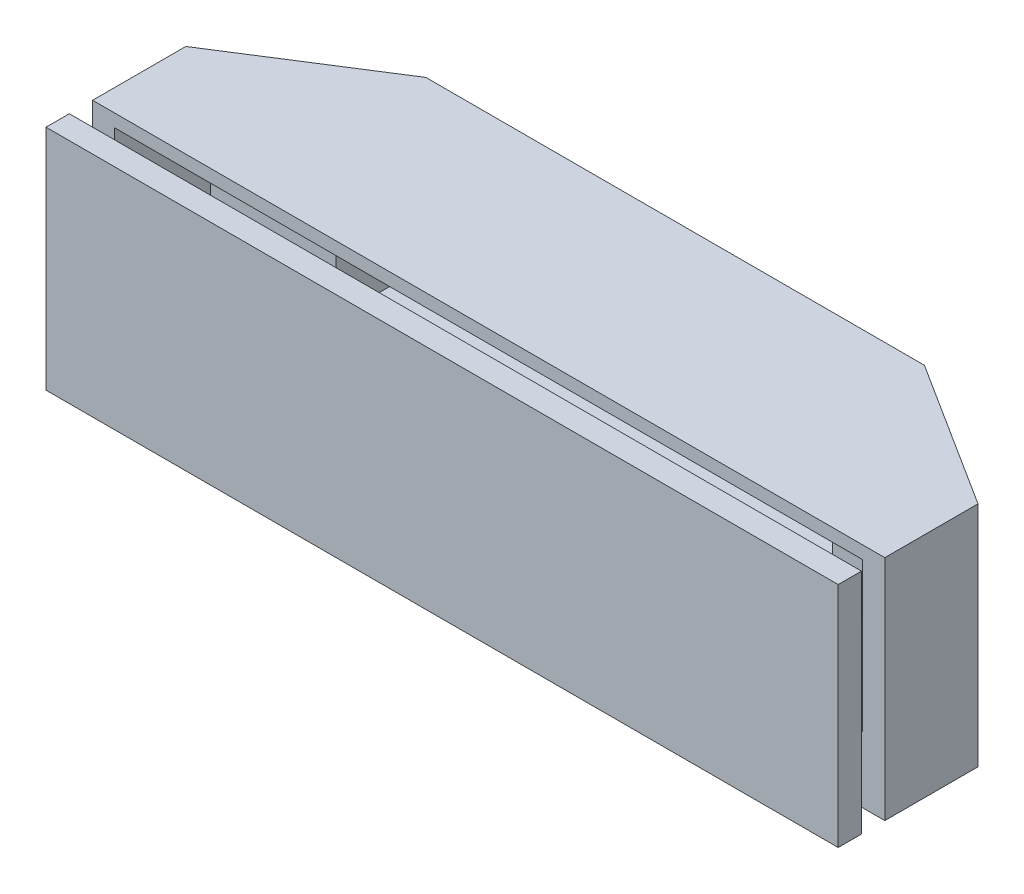
ISO-10303-21;
HEADER;
FILE_DESCRIPTION(('STEP AP214'),'2;1');
FILE_NAME('part.step','',(''),(''),'','','');
FILE_SCHEMA(('AUTOMOTIVE_DESIGN { 1 0 10303 214 1 1 1 1 }'));
ENDSEC;
DATA;
#1=APPLICATION_CONTEXT('core data for automotive mechanical design processes');
#2=APPLICATION_PROTOCOL_DEFINITION('international standard','automotive_design',2000,#1);
#3=PRODUCT_CONTEXT('',#1,'mechanical');
#4=PRODUCT('Part','Part','',(#3));
#5=PRODUCT_RELATED_PRODUCT_CATEGORY('part','',(#4));
#6=PRODUCT_DEFINITION_FORMATION('','',#4);
#7=PRODUCT_DEFINITION_CONTEXT('part definition',#1,'design');
#8=PRODUCT_DEFINITION('design','',#6,#7);
#9=PRODUCT_DEFINITION_SHAPE('','',#8);
#10=(LENGTH_UNIT() NAMED_UNIT(*) SI_UNIT(.MILLI.,.METRE.));
#11=(NAMED_UNIT(*) PLANE_ANGLE_UNIT() SI_UNIT($,.RADIAN.));
#12=(NAMED_UNIT(*) SI_UNIT($,.STERADIAN.) SOLID_ANGLE_UNIT());
#13=UNCERTAINTY_MEASURE_WITH_UNIT(LENGTH_MEASURE(1.E-05),#10,'distance_accuracy_value','');
#14=(GEOMETRIC_REPRESENTATION_CONTEXT(3) GLOBAL_UNCERTAINTY_ASSIGNED_CONTEXT((#13)) GLOBAL_UNIT_ASSIGNED_CONTEXT((#10,
#11,#12)) REPRESENTATION_CONTEXT('',''));
#15=CARTESIAN_POINT('',(0.,0.,0.));
#16=DIRECTION('',(0.,0.,1.));
#17=DIRECTION('',(1.,0.,0.));
#18=AXIS2_PLACEMENT_3D('',#15,#16,#17);
#19=CARTESIAN_POINT('',(-34.,-12.05,11.9446162465853));
#20=DIRECTION('',(0.,1.,0.));
#21=DIRECTION('',(0.,0.,1.));
#22=AXIS2_PLACEMENT_3D('',#19,#20,#21);
#23=PLANE('',#22);
#24=DIRECTION('',(1.,0.,0.));
#25=VECTOR('',#24,1.);
#26=CARTESIAN_POINT('',(-34.,-12.05,9.94461624658526));
#27=LINE('',#26,#25);
#28=CARTESIAN_POINT('',(-34.,-12.05,9.94461624658526));
#29=VERTEX_POINT('',#28);
#30=CARTESIAN_POINT('',(34.,-12.05,9.94461624658526));
#31=VERTEX_POINT('',#30);
#32=EDGE_CURVE('E112',#29,#31,#27,.T.);
#33=ORIENTED_EDGE('',*,*,#32,.T.);
#34=DIRECTION('',(0.,0.,-1.));
#35=VECTOR('',#34,1.);
#36=CARTESIAN_POINT('',(34.,-12.05,11.9446162465853));
#37=LINE('',#36,#35);
#38=CARTESIAN_POINT('',(34.,-12.05,11.9446162465853));
#39=VERTEX_POINT('',#38);
#40=EDGE_CURVE('E12',#39,#31,#37,.T.);
#41=ORIENTED_EDGE('',*,*,#40,.F.);
#42=DIRECTION('',(1.,0.,0.));
#43=VECTOR('',#42,1.);
#44=CARTESIAN_POINT('',(-34.,-12.05,11.9446162465853));
#45=LINE('',#44,#43);
#46=CARTESIAN_POINT('',(-34.,-12.05,11.9446162465853));
#47=VERTEX_POINT('',#46);
#48=EDGE_CURVE('E100',#47,#39,#45,.T.);
#49=ORIENTED_EDGE('',*,*,#48,.F.);
#50=DIRECTION('',(0.,0.,-1.));
#51=VECTOR('',#50,1.);
#52=CARTESIAN_POINT('',(-34.,-12.05,11.9446162465853));
#53=LINE('',#52,#51);
#54=EDGE_CURVE('E108',#47,#29,#53,.T.);
#55=ORIENTED_EDGE('',*,*,#54,.T.);
#56=EDGE_LOOP('',(#33,#41,#49,#55));
#57=FACE_BOUND('',#56,.T.);
#58=ADVANCED_FACE('F49',(#57),#23,.F.);
#59=CARTESIAN_POINT('',(34.,-12.05,11.9446162465853));
#60=DIRECTION('',(-1.,0.,0.));
#61=DIRECTION('',(0.,0.,1.));
#62=AXIS2_PLACEMENT_3D('',#59,#60,#61);
#63=PLANE('',#62);
#64=DIRECTION('',(0.,1.,0.));
#65=VECTOR('',#64,1.);
#66=CARTESIAN_POINT('',(34.,-12.05,9.94461624658526));
#67=LINE('',#66,#65);
#68=CARTESIAN_POINT('',(34.,7.5,9.94461624658526));
#69=VERTEX_POINT('',#68);
#70=EDGE_CURVE('E104',#31,#69,#67,.T.);
#71=ORIENTED_EDGE('',*,*,#70,.T.);
#72=DIRECTION('',(0.,0.,-1.));
#73=VECTOR('',#72,1.);
#74=CARTESIAN_POINT('',(34.,7.5,11.9446162465853));
#75=LINE('',#74,#73);
#76=CARTESIAN_POINT('',(34.,7.5,11.9446162465853));
#77=VERTEX_POINT('',#76);
#78=EDGE_CURVE('E57',#77,#69,#75,.T.);
#79=ORIENTED_EDGE('',*,*,#78,.F.);
#80=DIRECTION('',(0.,1.,0.));
#81=VECTOR('',#80,1.);
#82=CARTESIAN_POINT('',(34.,-12.05,11.9446162465853));
#83=LINE('',#82,#81);
#84=EDGE_CURVE('E95',#39,#77,#83,.T.);
#85=ORIENTED_EDGE('',*,*,#84,.F.);
#86=ORIENTED_EDGE('',*,*,#40,.T.);
#87=EDGE_LOOP('',(#71,#79,#85,#86));
#88=FACE_BOUND('',#87,.T.);
#89=ADVANCED_FACE('F103',(#88),#63,.F.);
#90=CARTESIAN_POINT('',(34.,7.5,11.9446162465853));
#91=DIRECTION('',(0.,-1.,0.));
#92=DIRECTION('',(0.,0.,-1.));
#93=AXIS2_PLACEMENT_3D('',#90,#91,#92);
#94=PLANE('',#93);
#95=DIRECTION('',(-1.,0.,0.));
#96=VECTOR('',#95,1.);
#97=CARTESIAN_POINT('',(34.,7.5,9.94461624658526));
#98=LINE('',#97,#96);
#99=CARTESIAN_POINT('',(-34.,7.5,9.94461624658526));
#100=VERTEX_POINT('',#99);
#101=EDGE_CURVE('E82',#69,#100,#98,.T.);
#102=ORIENTED_EDGE('',*,*,#101,.T.);
#103=DIRECTION('',(0.,0.,-1.));
#104=VECTOR('',#103,1.);
#105=CARTESIAN_POINT('',(-34.,7.5,11.9446162465853));
#106=LINE('',#105,#104);
#107=CARTESIAN_POINT('',(-34.,7.5,11.9446162465853));
#108=VERTEX_POINT('',#107);
#109=EDGE_CURVE('E105',#108,#100,#106,.T.);
#110=ORIENTED_EDGE('',*,*,#109,.F.);
#111=DIRECTION('',(-1.,0.,0.));
#112=VECTOR('',#111,1.);
#113=CARTESIAN_POINT('',(34.,7.5,11.9446162465853));
#114=LINE('',#113,#112);
#115=EDGE_CURVE('E98',#77,#108,#114,.T.);
#116=ORIENTED_EDGE('',*,*,#115,.F.);
#117=ORIENTED_EDGE('',*,*,#78,.T.);
#118=EDGE_LOOP('',(#102,#110,#116,#117));
#119=FACE_BOUND('',#118,.T.);
#120=ADVANCED_FACE('F106',(#119),#94,.F.);
#121=CARTESIAN_POINT('',(-34.,7.5,11.9446162465853));
#122=DIRECTION('',(1.,0.,0.));
#123=DIRECTION('',(0.,0.,-1.));
#124=AXIS2_PLACEMENT_3D('',#121,#122,#123);
#125=PLANE('',#124);
#126=DIRECTION('',(0.,-1.,0.));
#127=VECTOR('',#126,1.);
#128=CARTESIAN_POINT('',(-34.,7.5,9.94461624658526));
#129=LINE('',#128,#127);
#130=EDGE_CURVE('E88',#100,#29,#129,.T.);
#131=ORIENTED_EDGE('',*,*,#130,.T.);
#132=ORIENTED_EDGE('',*,*,#54,.F.);
#133=DIRECTION('',(0.,-1.,0.));
#134=VECTOR('',#133,1.);
#135=CARTESIAN_POINT('',(-34.,7.5,11.9446162465853));
#136=LINE('',#135,#134);
#137=EDGE_CURVE('E65',#108,#47,#136,.T.);
#138=ORIENTED_EDGE('',*,*,#137,.F.);
#139=ORIENTED_EDGE('',*,*,#109,.T.);
#140=EDGE_LOOP('',(#131,#132,#138,#139));
#141=FACE_BOUND('',#140,.T.);
#142=ADVANCED_FACE('F119',(#141),#125,.F.);
#143=CARTESIAN_POINT('',(0.,0.,11.9446162465853));
#144=DIRECTION('',(0.,0.,1.));
#145=DIRECTION('',(1.,0.,0.));
#146=AXIS2_PLACEMENT_3D('',#143,#144,#145);
#147=PLANE('',#146);
#148=ORIENTED_EDGE('',*,*,#48,.T.);
#149=ORIENTED_EDGE('',*,*,#84,.T.);
#150=ORIENTED_EDGE('',*,*,#115,.T.);
#151=ORIENTED_EDGE('',*,*,#137,.T.);
#152=EDGE_LOOP('',(#148,#149,#150,#151));
#153=FACE_BOUND('',#152,.T.);
#154=ADVANCED_FACE('F96',(#153),#147,.T.);
#155=CARTESIAN_POINT('',(0.,0.,9.94461624658526));
#156=DIRECTION('',(0.,0.,1.));
#157=DIRECTION('',(1.,0.,0.));
#158=AXIS2_PLACEMENT_3D('',#155,#156,#157);
#159=PLANE('',#158);
#160=ORIENTED_EDGE('',*,*,#32,.F.);
#161=ORIENTED_EDGE('',*,*,#130,.F.);
#162=ORIENTED_EDGE('',*,*,#101,.F.);
#163=ORIENTED_EDGE('',*,*,#70,.F.);
#164=EDGE_LOOP('',(#160,#161,#162,#163));
#165=FACE_BOUND('',#164,.T.);
#166=ADVANCED_FACE('F122',(#165),#159,.F.);
#167=CLOSED_SHELL('',(#58,#89,#120,#142,#154,#166));
#168=MANIFOLD_SOLID_BREP('B2_NOT_SHOWN',#167);
#169=CARTESIAN_POINT('',(21.3,6.4,-7.2));
#170=DIRECTION('',(1.,0.,0.));
#171=DIRECTION('',(0.,1.,0.));
#172=AXIS2_PLACEMENT_3D('',#169,#170,#171);
#173=PLANE('',#172);
#174=DIRECTION('',(0.,-1.,0.));
#175=VECTOR('',#174,1.);
#176=CARTESIAN_POINT('',(21.3,6.4,-0.25538375341474));
#177=LINE('',#176,#175);
#178=CARTESIAN_POINT('',(21.3,6.4,-0.25538375341474));
#179=VERTEX_POINT('',#178);
#180=CARTESIAN_POINT('',(21.3,-6.4,-0.25538375341474));
#181=VERTEX_POINT('',#180);
#182=EDGE_CURVE('E314',#179,#181,#177,.T.);
#183=ORIENTED_EDGE('',*,*,#182,.F.);
#184=DIRECTION('',(0.,0.,1.));
#185=VECTOR('',#184,1.);
#186=CARTESIAN_POINT('',(21.3,6.4,-7.2));
#187=LINE('',#186,#185);
#188=CARTESIAN_POINT('',(21.3,6.4,-7.2));
#189=VERTEX_POINT('',#188);
#190=EDGE_CURVE('E289',#189,#179,#187,.T.);
#191=ORIENTED_EDGE('',*,*,#190,.F.);
#192=DIRECTION('',(0.,1.,0.));
#193=VECTOR('',#192,1.);
#194=CARTESIAN_POINT('',(21.3,6.4,-7.2));
#195=LINE('',#194,#193);
#196=CARTESIAN_POINT('',(21.3,-6.4,-7.2));
#197=VERTEX_POINT('',#196);
#198=EDGE_CURVE('E320',#197,#189,#195,.T.);
#199=ORIENTED_EDGE('',*,*,#198,.F.);
#200=DIRECTION('',(0.,0.,1.));
#201=VECTOR('',#200,1.);
#202=CARTESIAN_POINT('',(21.3,-6.4,-7.2));
#203=LINE('',#202,#201);
#204=EDGE_CURVE('E332',#197,#181,#203,.T.);
#205=ORIENTED_EDGE('',*,*,#204,.T.);
#206=EDGE_LOOP('',(#183,#191,#199,#205));
#207=FACE_BOUND('',#206,.T.);
#208=ADVANCED_FACE('F172',(#207),#173,.F.);
#209=CARTESIAN_POINT('',(-21.3,6.4,-7.2));
#210=DIRECTION('',(-1.,0.,0.));
#211=DIRECTION('',(0.,0.,1.));
#212=AXIS2_PLACEMENT_3D('',#209,#210,#211);
#213=PLANE('',#212);
#214=DIRECTION('',(0.,1.,0.));
#215=VECTOR('',#214,1.);
#216=CARTESIAN_POINT('',(-21.3,6.4,-0.25538375341474));
#217=LINE('',#216,#215);
#218=CARTESIAN_POINT('',(-21.3,-6.4,-0.25538375341474));
#219=VERTEX_POINT('',#218);
#220=CARTESIAN_POINT('',(-21.3,6.4,-0.25538375341474));
#221=VERTEX_POINT('',#220);
#222=EDGE_CURVE('E307',#219,#221,#217,.T.);
#223=ORIENTED_EDGE('',*,*,#222,.F.);
#224=DIRECTION('',(0.,0.,1.));
#225=VECTOR('',#224,1.);
#226=CARTESIAN_POINT('',(-21.3,-6.4,-7.2));
#227=LINE('',#226,#225);
#228=CARTESIAN_POINT('',(-21.3,-6.4,-7.2));
#229=VERTEX_POINT('',#228);
#230=EDGE_CURVE('E336',#229,#219,#227,.T.);
#231=ORIENTED_EDGE('',*,*,#230,.F.);
#232=DIRECTION('',(0.,-1.,0.));
#233=VECTOR('',#232,1.);
#234=CARTESIAN_POINT('',(-21.3,6.4,-7.2));
#235=LINE('',#234,#233);
#236=CARTESIAN_POINT('',(-21.3,6.4,-7.2));
#237=VERTEX_POINT('',#236);
#238=EDGE_CURVE('E326',#237,#229,#235,.T.);
#239=ORIENTED_EDGE('',*,*,#238,.F.);
#240=DIRECTION('',(0.,0.,1.));
#241=VECTOR('',#240,1.);
#242=CARTESIAN_POINT('',(-21.3,6.4,-7.2));
#243=LINE('',#242,#241);
#244=EDGE_CURVE('E339',#237,#221,#243,.T.);
#245=ORIENTED_EDGE('',*,*,#244,.T.);
#246=EDGE_LOOP('',(#223,#231,#239,#245));
#247=FACE_BOUND('',#246,.T.);
#248=ADVANCED_FACE('F419',(#247),#213,.F.);
#249=CARTESIAN_POINT('',(34.,-12.05,7.94461624658526));
#250=DIRECTION('',(0.,0.,1.));
#251=DIRECTION('',(1.,0.,0.));
#252=AXIS2_PLACEMENT_3D('',#249,#250,#251);
#253=PLANE('',#252);
#254=DIRECTION('',(0.,1.,0.));
#255=VECTOR('',#254,1.);
#256=CARTESIAN_POINT('',(32.1,6.4,7.94461624658526));
#257=LINE('',#256,#255);
#258=CARTESIAN_POINT('',(32.1,-6.4,7.94461624658526));
#259=VERTEX_POINT('',#258);
#260=CARTESIAN_POINT('',(32.1,6.4,7.94461624658526));
#261=VERTEX_POINT('',#260);
#262=EDGE_CURVE('E282',#259,#261,#257,.T.);
#263=ORIENTED_EDGE('',*,*,#262,.F.);
#264=DIRECTION('',(1.,0.,0.));
#265=VECTOR('',#264,1.);
#266=CARTESIAN_POINT('',(-21.3,-6.4,7.94461624658526));
#267=LINE('',#266,#265);
#268=CARTESIAN_POINT('',(-32.1,-6.4,7.94461624658526));
#269=VERTEX_POINT('',#268);
#270=EDGE_CURVE('E318',#269,#259,#267,.T.);
#271=ORIENTED_EDGE('',*,*,#270,.F.);
#272=DIRECTION('',(0.,-1.,0.));
#273=VECTOR('',#272,1.);
#274=CARTESIAN_POINT('',(-32.1,6.4,7.94461624658526));
#275=LINE('',#274,#273);
#276=CARTESIAN_POINT('',(-32.1,6.4,7.94461624658526));
#277=VERTEX_POINT('',#276);
#278=EDGE_CURVE('E297',#277,#269,#275,.T.);
#279=ORIENTED_EDGE('',*,*,#278,.F.);
#280=DIRECTION('',(-1.,0.,0.));
#281=VECTOR('',#280,1.);
#282=CARTESIAN_POINT('',(-21.3,6.4,7.94461624658526));
#283=LINE('',#282,#281);
#284=EDGE_CURVE('E316',#261,#277,#283,.T.);
#285=ORIENTED_EDGE('',*,*,#284,.F.);
#286=EDGE_LOOP('',(#263,#271,#279,#285));
#287=FACE_BOUND('',#286,.T.);
#288=DIRECTION('',(0.,1.,0.));
#289=VECTOR('',#288,1.);
#290=CARTESIAN_POINT('',(34.,-12.05,7.94461624658526));
#291=LINE('',#290,#289);
#292=CARTESIAN_POINT('',(34.,-12.05,7.94461624658526));
#293=VERTEX_POINT('',#292);
#294=CARTESIAN_POINT('',(34.,7.5,7.94461624658526));
#295=VERTEX_POINT('',#294);
#296=EDGE_CURVE('E382',#293,#295,#291,.T.);
#297=ORIENTED_EDGE('',*,*,#296,.T.);
#298=DIRECTION('',(1.,0.,0.));
#299=VECTOR('',#298,1.);
#300=CARTESIAN_POINT('',(34.,7.5,7.94461624658526));
#301=LINE('',#300,#299);
#302=CARTESIAN_POINT('',(-34.,7.5,7.94461624658526));
#303=VERTEX_POINT('',#302);
#304=EDGE_CURVE('E345',#303,#295,#301,.T.);
#305=ORIENTED_EDGE('',*,*,#304,.F.);
#306=DIRECTION('',(0.,1.,0.));
#307=VECTOR('',#306,1.);
#308=CARTESIAN_POINT('',(-34.,-12.05,7.94461624658526));
#309=LINE('',#308,#307);
#310=CARTESIAN_POINT('',(-34.,-12.05,7.94461624658526));
#311=VERTEX_POINT('',#310);
#312=EDGE_CURVE('E176',#311,#303,#309,.T.);
#313=ORIENTED_EDGE('',*,*,#312,.F.);
#314=DIRECTION('',(1.,0.,0.));
#315=VECTOR('',#314,1.);
#316=CARTESIAN_POINT('',(34.,-12.05,7.94461624658526));
#317=LINE('',#316,#315);
#318=EDGE_CURVE('E363',#311,#293,#317,.T.);
#319=ORIENTED_EDGE('',*,*,#318,.T.);
#320=EDGE_LOOP('',(#297,#305,#313,#319));
#321=FACE_BOUND('',#320,.T.);
#322=ADVANCED_FACE('F389',(#287,#321),#253,.T.);
#323=CARTESIAN_POINT('',(-34.,-12.05,7.94461624658526));
#324=DIRECTION('',(-1.,0.,0.));
#325=DIRECTION('',(0.,0.,1.));
#326=AXIS2_PLACEMENT_3D('',#323,#324,#325);
#327=PLANE('',#326);
#328=ORIENTED_EDGE('',*,*,#312,.T.);
#329=DIRECTION('',(0.,0.,1.));
#330=VECTOR('',#329,1.);
#331=CARTESIAN_POINT('',(-34.,7.5,7.94461624658526));
#332=LINE('',#331,#330);
#333=CARTESIAN_POINT('',(-34.,7.5,-0.0553837534147412));
#334=VERTEX_POINT('',#333);
#335=EDGE_CURVE('E335',#334,#303,#332,.T.);
#336=ORIENTED_EDGE('',*,*,#335,.F.);
#337=DIRECTION('',(0.,1.,0.));
#338=VECTOR('',#337,1.);
#339=CARTESIAN_POINT('',(-34.,-12.05,-0.0553837534147412));
#340=LINE('',#339,#338);
#341=CARTESIAN_POINT('',(-34.,-12.05,-0.0553837534147412));
#342=VERTEX_POINT('',#341);
#343=EDGE_CURVE('E47',#342,#334,#340,.T.);
#344=ORIENTED_EDGE('',*,*,#343,.F.);
#345=DIRECTION('',(0.,0.,1.));
#346=VECTOR('',#345,1.);
#347=CARTESIAN_POINT('',(-34.,-12.05,7.94461624658526));
#348=LINE('',#347,#346);
#349=EDGE_CURVE('E360',#342,#311,#348,.T.);
#350=ORIENTED_EDGE('',*,*,#349,.T.);
#351=EDGE_LOOP('',(#328,#336,#344,#350));
#352=FACE_BOUND('',#351,.T.);
#353=ADVANCED_FACE('F174',(#352),#327,.T.);
#354=CARTESIAN_POINT('',(-34.,-12.05,-0.0553837534147412));
#355=DIRECTION('',(-0.536008136665272,0.,-0.844212815247804));
#356=DIRECTION('',(-0.844212815247804,0.,0.536008136665272));
#357=AXIS2_PLACEMENT_3D('',#354,#355,#356);
#358=PLANE('',#357);
#359=ORIENTED_EDGE('',*,*,#343,.T.);
#360=DIRECTION('',(-0.844212815247804,0.,0.536008136665272));
#361=VECTOR('',#360,1.);
#362=CARTESIAN_POINT('',(-34.,7.5,-0.0553837534147412));
#363=LINE('',#362,#361);
#364=CARTESIAN_POINT('',(-21.4,7.5,-8.05538375341474));
#365=VERTEX_POINT('',#364);
#366=EDGE_CURVE('E357',#365,#334,#363,.T.);
#367=ORIENTED_EDGE('',*,*,#366,.F.);
#368=DIRECTION('',(0.,1.,0.));
#369=VECTOR('',#368,1.);
#370=CARTESIAN_POINT('',(-21.4,-12.05,-8.05538375341474));
#371=LINE('',#370,#369);
#372=CARTESIAN_POINT('',(-21.4,-12.05,-8.05538375341474));
#373=VERTEX_POINT('',#372);
#374=EDGE_CURVE('E181',#373,#365,#371,.T.);
#375=ORIENTED_EDGE('',*,*,#374,.F.);
#376=DIRECTION('',(-0.844212815247804,0.,0.536008136665272));
#377=VECTOR('',#376,1.);
#378=CARTESIAN_POINT('',(-34.,-12.05,-0.0553837534147412));
#379=LINE('',#378,#377);
#380=EDGE_CURVE('E375',#373,#342,#379,.T.);
#381=ORIENTED_EDGE('',*,*,#380,.T.);
#382=EDGE_LOOP('',(#359,#367,#375,#381));
#383=FACE_BOUND('',#382,.T.);
#384=ADVANCED_FACE('F396',(#383),#358,.T.);
#385=CARTESIAN_POINT('',(-21.4,-12.05,-8.05538375341474));
#386=DIRECTION('',(0.,0.,-1.));
#387=DIRECTION('',(-1.,0.,0.));
#388=AXIS2_PLACEMENT_3D('',#385,#386,#387);
#389=PLANE('',#388);
#390=ORIENTED_EDGE('',*,*,#374,.T.);
#391=DIRECTION('',(-1.,0.,0.));
#392=VECTOR('',#391,1.);
#393=CARTESIAN_POINT('',(-21.4,7.5,-8.05538375341474));
#394=LINE('',#393,#392);
#395=CARTESIAN_POINT('',(21.4,7.5,-8.05538375341474));
#396=VERTEX_POINT('',#395);
#397=EDGE_CURVE('E354',#396,#365,#394,.T.);
#398=ORIENTED_EDGE('',*,*,#397,.F.);
#399=DIRECTION('',(0.,1.,0.));
#400=VECTOR('',#399,1.);
#401=CARTESIAN_POINT('',(21.4,-12.05,-8.05538375341474));
#402=LINE('',#401,#400);
#403=CARTESIAN_POINT('',(21.4,-12.05,-8.05538375341474));
#404=VERTEX_POINT('',#403);
#405=EDGE_CURVE('E379',#404,#396,#402,.T.);
#406=ORIENTED_EDGE('',*,*,#405,.F.);
#407=DIRECTION('',(-1.,0.,0.));
#408=VECTOR('',#407,1.);
#409=CARTESIAN_POINT('',(-21.4,-12.05,-8.05538375341474));
#410=LINE('',#409,#408);
#411=EDGE_CURVE('E372',#404,#373,#410,.T.);
#412=ORIENTED_EDGE('',*,*,#411,.T.);
#413=EDGE_LOOP('',(#390,#398,#406,#412));
#414=FACE_BOUND('',#413,.T.);
#415=ADVANCED_FACE('F409',(#414),#389,.T.);
#416=CARTESIAN_POINT('',(21.4,-12.05,-8.05538375341474));
#417=DIRECTION('',(0.536008136665272,0.,-0.844212815247804));
#418=DIRECTION('',(-0.844212815247804,0.,-0.536008136665272));
#419=AXIS2_PLACEMENT_3D('',#416,#417,#418);
#420=PLANE('',#419);
#421=ORIENTED_EDGE('',*,*,#405,.T.);
#422=DIRECTION('',(-0.844212815247804,0.,-0.536008136665272));
#423=VECTOR('',#422,1.);
#424=CARTESIAN_POINT('',(21.4,7.5,-8.05538375341474));
#425=LINE('',#424,#423);
#426=CARTESIAN_POINT('',(34.,7.5,-0.0553837534147412));
#427=VERTEX_POINT('',#426);
#428=EDGE_CURVE('E351',#427,#396,#425,.T.);
#429=ORIENTED_EDGE('',*,*,#428,.F.);
#430=DIRECTION('',(0.,1.,0.));
#431=VECTOR('',#430,1.);
#432=CARTESIAN_POINT('',(34.,-12.05,-0.0553837534147412));
#433=LINE('',#432,#431);
#434=CARTESIAN_POINT('',(34.,-12.05,-0.0553837534147412));
#435=VERTEX_POINT('',#434);
#436=EDGE_CURVE('E381',#435,#427,#433,.T.);
#437=ORIENTED_EDGE('',*,*,#436,.F.);
#438=DIRECTION('',(-0.844212815247804,0.,-0.536008136665272));
#439=VECTOR('',#438,1.);
#440=CARTESIAN_POINT('',(21.4,-12.05,-8.05538375341474));
#441=LINE('',#440,#439);
#442=EDGE_CURVE('E369',#435,#404,#441,.T.);
#443=ORIENTED_EDGE('',*,*,#442,.T.);
#444=EDGE_LOOP('',(#421,#429,#437,#443));
#445=FACE_BOUND('',#444,.T.);
#446=ADVANCED_FACE('F407',(#445),#420,.T.);
#447=CARTESIAN_POINT('',(34.,-12.05,-0.0553837534147412));
#448=DIRECTION('',(1.,0.,0.));
#449=DIRECTION('',(0.,0.,-1.));
#450=AXIS2_PLACEMENT_3D('',#447,#448,#449);
#451=PLANE('',#450);
#452=ORIENTED_EDGE('',*,*,#436,.T.);
#453=DIRECTION('',(0.,0.,-1.));
#454=VECTOR('',#453,1.);
#455=CARTESIAN_POINT('',(34.,7.5,-0.0553837534147412));
#456=LINE('',#455,#454);
#457=EDGE_CURVE('E348',#295,#427,#456,.T.);
#458=ORIENTED_EDGE('',*,*,#457,.F.);
#459=ORIENTED_EDGE('',*,*,#296,.F.);
#460=DIRECTION('',(0.,0.,-1.));
#461=VECTOR('',#460,1.);
#462=CARTESIAN_POINT('',(34.,-12.05,-0.0553837534147412));
#463=LINE('',#462,#461);
#464=EDGE_CURVE('E366',#293,#435,#463,.T.);
#465=ORIENTED_EDGE('',*,*,#464,.T.);
#466=EDGE_LOOP('',(#452,#458,#459,#465));
#467=FACE_BOUND('',#466,.T.);
#468=ADVANCED_FACE('F404',(#467),#451,.T.);
#469=CARTESIAN_POINT('',(0.,-12.05,0.));
#470=DIRECTION('',(0.,-1.,0.));
#471=DIRECTION('',(0.,0.,-1.));
#472=AXIS2_PLACEMENT_3D('',#469,#470,#471);
#473=PLANE('',#472);
#474=ORIENTED_EDGE('',*,*,#349,.F.);
#475=ORIENTED_EDGE('',*,*,#380,.F.);
#476=ORIENTED_EDGE('',*,*,#411,.F.);
#477=ORIENTED_EDGE('',*,*,#442,.F.);
#478=ORIENTED_EDGE('',*,*,#464,.F.);
#479=ORIENTED_EDGE('',*,*,#318,.F.);
#480=EDGE_LOOP('',(#474,#475,#476,#477,#478,#479));
#481=FACE_BOUND('',#480,.T.);
#482=ADVANCED_FACE('F399',(#481),#473,.T.);
#483=CARTESIAN_POINT('',(0.,7.5,0.));
#484=DIRECTION('',(0.,-1.,0.));
#485=DIRECTION('',(0.,0.,-1.));
#486=AXIS2_PLACEMENT_3D('',#483,#484,#485);
#487=PLANE('',#486);
#488=ORIENTED_EDGE('',*,*,#335,.T.);
#489=ORIENTED_EDGE('',*,*,#304,.T.);
#490=ORIENTED_EDGE('',*,*,#457,.T.);
#491=ORIENTED_EDGE('',*,*,#428,.T.);
#492=ORIENTED_EDGE('',*,*,#397,.T.);
#493=ORIENTED_EDGE('',*,*,#366,.T.);
#494=EDGE_LOOP('',(#488,#489,#490,#491,#492,#493));
#495=FACE_BOUND('',#494,.T.);
#496=ADVANCED_FACE('F392',(#495),#487,.F.);
#497=CARTESIAN_POINT('',(-21.3,-6.4,-7.2));
#498=DIRECTION('',(0.,-1.,0.));
#499=DIRECTION('',(0.,0.,-1.));
#500=AXIS2_PLACEMENT_3D('',#497,#498,#499);
#501=PLANE('',#500);
#502=ORIENTED_EDGE('',*,*,#270,.T.);
#503=DIRECTION('',(0.,0.,1.));
#504=VECTOR('',#503,1.);
#505=CARTESIAN_POINT('',(32.1,-6.4,-0.25538375341474));
#506=LINE('',#505,#504);
#507=CARTESIAN_POINT('',(32.1,-6.4,-0.25538375341474));
#508=VERTEX_POINT('',#507);
#509=EDGE_CURVE('E305',#508,#259,#506,.T.);
#510=ORIENTED_EDGE('',*,*,#509,.F.);
#511=DIRECTION('',(1.,0.,0.));
#512=VECTOR('',#511,1.);
#513=CARTESIAN_POINT('',(-32.1,-6.4,-0.25538375341474));
#514=LINE('',#513,#512);
#515=EDGE_CURVE('E295',#181,#508,#514,.T.);
#516=ORIENTED_EDGE('',*,*,#515,.F.);
#517=ORIENTED_EDGE('',*,*,#204,.F.);
#518=DIRECTION('',(1.,0.,0.));
#519=VECTOR('',#518,1.);
#520=CARTESIAN_POINT('',(-21.3,-6.4,-7.2));
#521=LINE('',#520,#519);
#522=EDGE_CURVE('E329',#229,#197,#521,.T.);
#523=ORIENTED_EDGE('',*,*,#522,.F.);
#524=ORIENTED_EDGE('',*,*,#230,.T.);
#525=CARTESIAN_POINT('',(-32.1,-6.4,-0.25538375341474));
#526=VERTEX_POINT('',#525);
#527=EDGE_CURVE('E189',#526,#219,#514,.T.);
#528=ORIENTED_EDGE('',*,*,#527,.F.);
#529=DIRECTION('',(0.,0.,1.));
#530=VECTOR('',#529,1.);
#531=CARTESIAN_POINT('',(-32.1,-6.4,-0.25538375341474));
#532=LINE('',#531,#530);
#533=EDGE_CURVE('E308',#526,#269,#532,.T.);
#534=ORIENTED_EDGE('',*,*,#533,.T.);
#535=EDGE_LOOP('',(#502,#510,#516,#517,#523,#524,#528,#534));
#536=FACE_BOUND('',#535,.T.);
#537=ADVANCED_FACE('F431',(#536),#501,.F.);
#538=CARTESIAN_POINT('',(-21.3,6.4,-7.2));
#539=DIRECTION('',(0.,1.,0.));
#540=DIRECTION('',(0.,0.,1.));
#541=AXIS2_PLACEMENT_3D('',#538,#539,#540);
#542=PLANE('',#541);
#543=ORIENTED_EDGE('',*,*,#284,.T.);
#544=DIRECTION('',(0.,0.,1.));
#545=VECTOR('',#544,1.);
#546=CARTESIAN_POINT('',(-32.1,6.4,-0.25538375341474));
#547=LINE('',#546,#545);
#548=CARTESIAN_POINT('',(-32.1,6.4,-0.25538375341474));
#549=VERTEX_POINT('',#548);
#550=EDGE_CURVE('E284',#549,#277,#547,.T.);
#551=ORIENTED_EDGE('',*,*,#550,.F.);
#552=DIRECTION('',(-1.,0.,0.));
#553=VECTOR('',#552,1.);
#554=CARTESIAN_POINT('',(-32.1,6.4,-0.25538375341474));
#555=LINE('',#554,#553);
#556=EDGE_CURVE('E291',#221,#549,#555,.T.);
#557=ORIENTED_EDGE('',*,*,#556,.F.);
#558=ORIENTED_EDGE('',*,*,#244,.F.);
#559=DIRECTION('',(-1.,0.,0.));
#560=VECTOR('',#559,1.);
#561=CARTESIAN_POINT('',(-21.3,6.4,-7.2));
#562=LINE('',#561,#560);
#563=EDGE_CURVE('E323',#189,#237,#562,.T.);
#564=ORIENTED_EDGE('',*,*,#563,.F.);
#565=ORIENTED_EDGE('',*,*,#190,.T.);
#566=CARTESIAN_POINT('',(32.1,6.4,-0.25538375341474));
#567=VERTEX_POINT('',#566);
#568=EDGE_CURVE('E197',#567,#179,#555,.T.);
#569=ORIENTED_EDGE('',*,*,#568,.F.);
#570=DIRECTION('',(0.,0.,1.));
#571=VECTOR('',#570,1.);
#572=CARTESIAN_POINT('',(32.1,6.4,-0.25538375341474));
#573=LINE('',#572,#571);
#574=EDGE_CURVE('E277',#567,#261,#573,.T.);
#575=ORIENTED_EDGE('',*,*,#574,.T.);
#576=EDGE_LOOP('',(#543,#551,#557,#558,#564,#565,#569,#575));
#577=FACE_BOUND('',#576,.T.);
#578=ADVANCED_FACE('F287',(#577),#542,.F.);
#579=CARTESIAN_POINT('',(0.,0.,-7.2));
#580=DIRECTION('',(0.,0.,1.));
#581=DIRECTION('',(1.,0.,0.));
#582=AXIS2_PLACEMENT_3D('',#579,#580,#581);
#583=PLANE('',#582);
#584=ORIENTED_EDGE('',*,*,#198,.T.);
#585=ORIENTED_EDGE('',*,*,#563,.T.);
#586=ORIENTED_EDGE('',*,*,#238,.T.);
#587=ORIENTED_EDGE('',*,*,#522,.T.);
#588=EDGE_LOOP('',(#584,#585,#586,#587));
#589=FACE_BOUND('',#588,.T.);
#590=ADVANCED_FACE('F455',(#589),#583,.T.);
#591=CARTESIAN_POINT('',(0.,0.,-0.25538375341474));
#592=DIRECTION('',(0.,0.,1.));
#593=DIRECTION('',(1.,0.,0.));
#594=AXIS2_PLACEMENT_3D('',#591,#592,#593);
#595=PLANE('',#594);
#596=ORIENTED_EDGE('',*,*,#222,.T.);
#597=ORIENTED_EDGE('',*,*,#556,.T.);
#598=DIRECTION('',(0.,-1.,0.));
#599=VECTOR('',#598,1.);
#600=CARTESIAN_POINT('',(-32.1,6.4,-0.25538375341474));
#601=LINE('',#600,#599);
#602=EDGE_CURVE('E290',#549,#526,#601,.T.);
#603=ORIENTED_EDGE('',*,*,#602,.T.);
#604=ORIENTED_EDGE('',*,*,#527,.T.);
#605=EDGE_LOOP('',(#596,#597,#603,#604));
#606=FACE_BOUND('',#605,.T.);
#607=ADVANCED_FACE('F450',(#606),#595,.T.);
#608=CARTESIAN_POINT('',(-32.1,6.4,-0.25538375341474));
#609=DIRECTION('',(-1.,0.,0.));
#610=DIRECTION('',(0.,0.,1.));
#611=AXIS2_PLACEMENT_3D('',#608,#609,#610);
#612=PLANE('',#611);
#613=ORIENTED_EDGE('',*,*,#278,.T.);
#614=ORIENTED_EDGE('',*,*,#533,.F.);
#615=ORIENTED_EDGE('',*,*,#602,.F.);
#616=ORIENTED_EDGE('',*,*,#550,.T.);
#617=EDGE_LOOP('',(#613,#614,#615,#616));
#618=FACE_BOUND('',#617,.T.);
#619=ADVANCED_FACE('F449',(#618),#612,.F.);
#620=ORIENTED_EDGE('',*,*,#182,.T.);
#621=ORIENTED_EDGE('',*,*,#515,.T.);
#622=DIRECTION('',(0.,1.,0.));
#623=VECTOR('',#622,1.);
#624=CARTESIAN_POINT('',(32.1,6.4,-0.25538375341474));
#625=LINE('',#624,#623);
#626=EDGE_CURVE('E280',#508,#567,#625,.T.);
#627=ORIENTED_EDGE('',*,*,#626,.T.);
#628=ORIENTED_EDGE('',*,*,#568,.T.);
#629=EDGE_LOOP('',(#620,#621,#627,#628));
#630=FACE_BOUND('',#629,.T.);
#631=ADVANCED_FACE('F293',(#630),#595,.T.);
#632=CARTESIAN_POINT('',(32.1,6.4,-0.25538375341474));
#633=DIRECTION('',(1.,0.,0.));
#634=DIRECTION('',(0.,0.,-1.));
#635=AXIS2_PLACEMENT_3D('',#632,#633,#634);
#636=PLANE('',#635);
#637=ORIENTED_EDGE('',*,*,#262,.T.);
#638=ORIENTED_EDGE('',*,*,#574,.F.);
#639=ORIENTED_EDGE('',*,*,#626,.F.);
#640=ORIENTED_EDGE('',*,*,#509,.T.);
#641=EDGE_LOOP('',(#637,#638,#639,#640));
#642=FACE_BOUND('',#641,.T.);
#643=ADVANCED_FACE('F278',(#642),#636,.F.);
#644=CLOSED_SHELL('',(#208,#248,#322,#353,#384,#415,#446,#468,#482,#496,#537,#578,#590,#607,
#619,#631,#643));
#645=MANIFOLD_SOLID_BREP('B6',#644);
#646=ADVANCED_BREP_SHAPE_REPRESENTATION('',(#18,#168,#645),#14);
#647=SHAPE_DEFINITION_REPRESENTATION(#9,#646);
ENDSEC;
END-ISO-10303-21;
